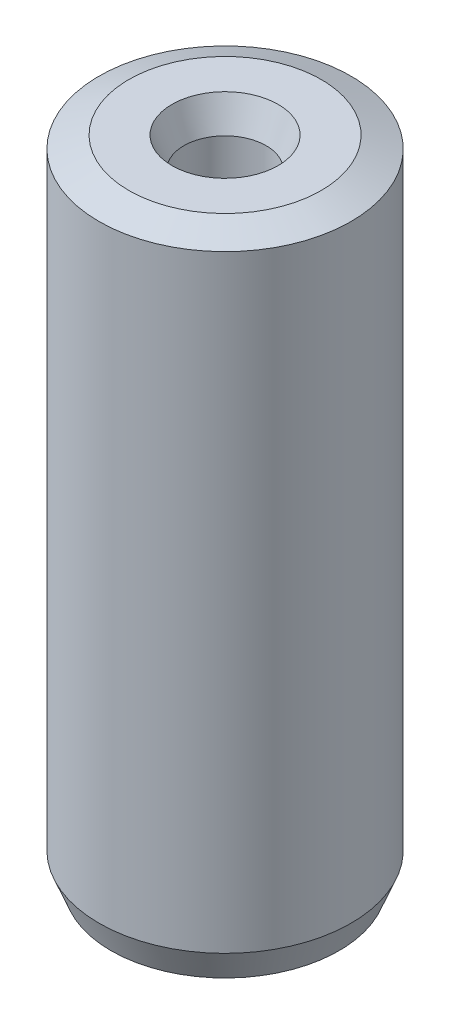
ISO-10303-21;
HEADER;
FILE_DESCRIPTION(('STEP AP214'),'2;1');
FILE_NAME('part.step','',(''),(''),'','','');
FILE_SCHEMA(('AUTOMOTIVE_DESIGN { 1 0 10303 214 1 1 1 1 }'));
ENDSEC;
DATA;
#1=APPLICATION_CONTEXT('core data for automotive mechanical design processes');
#2=APPLICATION_PROTOCOL_DEFINITION('international standard','automotive_design',2000,#1);
#3=PRODUCT_CONTEXT('',#1,'mechanical');
#4=PRODUCT('Part','Part','',(#3));
#5=PRODUCT_RELATED_PRODUCT_CATEGORY('part','',(#4));
#6=PRODUCT_DEFINITION_FORMATION('','',#4);
#7=PRODUCT_DEFINITION_CONTEXT('part definition',#1,'design');
#8=PRODUCT_DEFINITION('design','',#6,#7);
#9=PRODUCT_DEFINITION_SHAPE('','',#8);
#10=(LENGTH_UNIT() NAMED_UNIT(*) SI_UNIT(.MILLI.,.METRE.));
#11=(NAMED_UNIT(*) PLANE_ANGLE_UNIT() SI_UNIT($,.RADIAN.));
#12=(NAMED_UNIT(*) SI_UNIT($,.STERADIAN.) SOLID_ANGLE_UNIT());
#13=UNCERTAINTY_MEASURE_WITH_UNIT(LENGTH_MEASURE(1.E-05),#10,'distance_accuracy_value','');
#14=(GEOMETRIC_REPRESENTATION_CONTEXT(3) GLOBAL_UNCERTAINTY_ASSIGNED_CONTEXT((#13)) GLOBAL_UNIT_ASSIGNED_CONTEXT((#10,
#11,#12)) REPRESENTATION_CONTEXT('',''));
#15=CARTESIAN_POINT('',(0.,0.,0.));
#16=DIRECTION('',(0.,0.,1.));
#17=DIRECTION('',(1.,0.,0.));
#18=AXIS2_PLACEMENT_3D('',#15,#16,#17);
#19=CARTESIAN_POINT('',(0.,25.7761037893323,0.));
#20=DIRECTION('',(0.,-1.,0.));
#21=DIRECTION('',(0.,0.,-1.));
#22=AXIS2_PLACEMENT_3D('',#19,#20,#21);
#23=CYLINDRICAL_SURFACE('',#22,5.);
#24=CARTESIAN_POINT('',(0.,1.18209403228599,0.));
#25=DIRECTION('',(0.,1.,0.));
#26=DIRECTION('',(0.,0.,1.));
#27=AXIS2_PLACEMENT_3D('',#24,#25,#26);
#28=CIRCLE('',#27,5.);
#29=CARTESIAN_POINT('',(0.,1.18209403228599,5.));
#30=VERTEX_POINT('',#29);
#31=EDGE_CURVE('E10',#30,#30,#28,.T.);
#32=ORIENTED_EDGE('',*,*,#31,.T.);
#33=EDGE_LOOP('',(#32));
#34=FACE_BOUND('',#33,.T.);
#35=CARTESIAN_POINT('',(0.,25.3019508736875,0.));
#36=DIRECTION('',(0.,1.,0.));
#37=DIRECTION('',(0.,0.,1.));
#38=AXIS2_PLACEMENT_3D('',#35,#36,#37);
#39=CIRCLE('',#38,5.);
#40=CARTESIAN_POINT('',(0.,25.3019508736875,5.));
#41=VERTEX_POINT('',#40);
#42=EDGE_CURVE('E50',#41,#41,#39,.F.);
#43=ORIENTED_EDGE('',*,*,#42,.T.);
#44=EDGE_LOOP('',(#43));
#45=FACE_BOUND('',#44,.T.);
#46=ADVANCED_FACE('F39',(#34,#45),#23,.T.);
#47=CARTESIAN_POINT('',(0.,25.7761037893323,0.));
#48=DIRECTION('',(0.,1.,0.));
#49=DIRECTION('',(0.,0.,1.));
#50=AXIS2_PLACEMENT_3D('',#47,#48,#49);
#51=PLANE('',#50);
#52=CARTESIAN_POINT('',(0.,25.7761037893323,0.));
#53=DIRECTION('',(0.,1.,0.));
#54=DIRECTION('',(0.,0.,1.));
#55=AXIS2_PLACEMENT_3D('',#52,#53,#54);
#56=CIRCLE('',#55,2.10690864867009);
#57=CARTESIAN_POINT('',(0.,25.7761037893323,2.10690864867009));
#58=VERTEX_POINT('',#57);
#59=EDGE_CURVE('E58',#58,#58,#56,.F.);
#60=ORIENTED_EDGE('',*,*,#59,.T.);
#61=EDGE_LOOP('',(#60));
#62=FACE_BOUND('',#61,.T.);
#63=CARTESIAN_POINT('',(0.,25.7761037893323,0.));
#64=DIRECTION('',(0.,1.,0.));
#65=DIRECTION('',(0.,0.,1.));
#66=AXIS2_PLACEMENT_3D('',#63,#64,#65);
#67=CIRCLE('',#66,3.81790596771398);
#68=CARTESIAN_POINT('',(0.,25.7761037893323,3.81790596771398));
#69=VERTEX_POINT('',#68);
#70=EDGE_CURVE('E61',#69,#69,#67,.T.);
#71=ORIENTED_EDGE('',*,*,#70,.T.);
#72=EDGE_LOOP('',(#71));
#73=FACE_BOUND('',#72,.T.);
#74=ADVANCED_FACE('F88',(#62,#73),#51,.T.);
#75=CARTESIAN_POINT('',(0.,0.,0.));
#76=DIRECTION('',(0.,1.,0.));
#77=DIRECTION('',(0.,0.,1.));
#78=AXIS2_PLACEMENT_3D('',#75,#76,#77);
#79=PLANE('',#78);
#80=CARTESIAN_POINT('',(0.,0.,0.));
#81=DIRECTION('',(0.,1.,0.));
#82=DIRECTION('',(0.,0.,1.));
#83=AXIS2_PLACEMENT_3D('',#80,#81,#82);
#84=CIRCLE('',#83,2.81484976531127);
#85=CARTESIAN_POINT('',(0.,0.,2.81484976531127));
#86=VERTEX_POINT('',#85);
#87=EDGE_CURVE('E51',#86,#86,#84,.T.);
#88=ORIENTED_EDGE('',*,*,#87,.T.);
#89=EDGE_LOOP('',(#88));
#90=FACE_BOUND('',#89,.T.);
#91=CARTESIAN_POINT('',(0.,0.,0.));
#92=DIRECTION('',(0.,1.,0.));
#93=DIRECTION('',(0.,0.,1.));
#94=AXIS2_PLACEMENT_3D('',#91,#92,#93);
#95=CIRCLE('',#94,4.52584708435518);
#96=CARTESIAN_POINT('',(0.,0.,4.52584708435518));
#97=VERTEX_POINT('',#96);
#98=EDGE_CURVE('E54',#97,#97,#95,.F.);
#99=ORIENTED_EDGE('',*,*,#98,.T.);
#100=EDGE_LOOP('',(#99));
#101=FACE_BOUND('',#100,.T.);
#102=ADVANCED_FACE('F83',(#90,#101),#79,.F.);
#103=CARTESIAN_POINT('',(0.,25.7761037893323,0.));
#104=DIRECTION('',(0.,-1.,0.));
#105=DIRECTION('',(0.,0.,-1.));
#106=AXIS2_PLACEMENT_3D('',#103,#104,#105);
#107=CYLINDRICAL_SURFACE('',#106,1.63275573302526);
#108=CARTESIAN_POINT('',(0.,24.5940097570463,0.));
#109=DIRECTION('',(0.,1.,0.));
#110=DIRECTION('',(0.,0.,1.));
#111=AXIS2_PLACEMENT_3D('',#108,#109,#110);
#112=CIRCLE('',#111,1.63275573302526);
#113=CARTESIAN_POINT('',(0.,24.5940097570463,1.63275573302526));
#114=VERTEX_POINT('',#113);
#115=EDGE_CURVE('E67',#114,#114,#112,.T.);
#116=ORIENTED_EDGE('',*,*,#115,.T.);
#117=EDGE_LOOP('',(#116));
#118=FACE_BOUND('',#117,.T.);
#119=CARTESIAN_POINT('',(0.,0.474152915644833,0.));
#120=DIRECTION('',(0.,1.,0.));
#121=DIRECTION('',(0.,0.,1.));
#122=AXIS2_PLACEMENT_3D('',#119,#120,#121);
#123=CIRCLE('',#122,1.63275573302526);
#124=CARTESIAN_POINT('',(0.,0.474152915644833,1.63275573302526));
#125=VERTEX_POINT('',#124);
#126=EDGE_CURVE('E69',#125,#125,#123,.F.);
#127=ORIENTED_EDGE('',*,*,#126,.T.);
#128=EDGE_LOOP('',(#127));
#129=FACE_BOUND('',#128,.T.);
#130=ADVANCED_FACE('F71',(#118,#129),#107,.F.);
#131=CARTESIAN_POINT('',(0.,24.5940097570463,0.));
#132=DIRECTION('',(0.,1.,0.));
#133=DIRECTION('',(0.,0.,1.));
#134=AXIS2_PLACEMENT_3D('',#131,#132,#133);
#135=CONICAL_SURFACE('',#134,1.63275573302526,0.381465223361848);
#136=ORIENTED_EDGE('',*,*,#59,.F.);
#137=EDGE_LOOP('',(#136));
#138=FACE_BOUND('',#137,.T.);
#139=ORIENTED_EDGE('',*,*,#115,.F.);
#140=EDGE_LOOP('',(#139));
#141=FACE_BOUND('',#140,.T.);
#142=ADVANCED_FACE('F77',(#138,#141),#135,.F.);
#143=CARTESIAN_POINT('',(0.,0.,0.));
#144=DIRECTION('',(0.,-1.,0.));
#145=DIRECTION('',(0.,0.,-1.));
#146=AXIS2_PLACEMENT_3D('',#143,#144,#145);
#147=CONICAL_SURFACE('',#146,2.81484976531127,1.18933110343304);
#148=ORIENTED_EDGE('',*,*,#126,.F.);
#149=EDGE_LOOP('',(#148));
#150=FACE_BOUND('',#149,.T.);
#151=ORIENTED_EDGE('',*,*,#87,.F.);
#152=EDGE_LOOP('',(#151));
#153=FACE_BOUND('',#152,.T.);
#154=ADVANCED_FACE('F73',(#150,#153),#147,.F.);
#155=CARTESIAN_POINT('',(0.,1.18209403228599,0.));
#156=DIRECTION('',(0.,1.,0.));
#157=DIRECTION('',(0.,0.,1.));
#158=AXIS2_PLACEMENT_3D('',#155,#156,#157);
#159=CONICAL_SURFACE('',#158,5.,0.381465223361852);
#160=ORIENTED_EDGE('',*,*,#98,.F.);
#161=EDGE_LOOP('',(#160));
#162=FACE_BOUND('',#161,.T.);
#163=ORIENTED_EDGE('',*,*,#31,.F.);
#164=EDGE_LOOP('',(#163));
#165=FACE_BOUND('',#164,.T.);
#166=ADVANCED_FACE('F76',(#162,#165),#159,.T.);
#167=CARTESIAN_POINT('',(0.,25.7761037893323,0.));
#168=DIRECTION('',(0.,-1.,0.));
#169=DIRECTION('',(0.,0.,-1.));
#170=AXIS2_PLACEMENT_3D('',#167,#168,#169);
#171=CONICAL_SURFACE('',#170,3.81790596771398,1.18933110343305);
#172=ORIENTED_EDGE('',*,*,#42,.F.);
#173=EDGE_LOOP('',(#172));
#174=FACE_BOUND('',#173,.T.);
#175=ORIENTED_EDGE('',*,*,#70,.F.);
#176=EDGE_LOOP('',(#175));
#177=FACE_BOUND('',#176,.T.);
#178=ADVANCED_FACE('F45',(#174,#177),#171,.T.);
#179=CLOSED_SHELL('',(#46,#74,#102,#130,#142,#154,#166,#178));
#180=MANIFOLD_SOLID_BREP('B2',#179);
#181=ADVANCED_BREP_SHAPE_REPRESENTATION('',(#18,#180),#14);
#182=SHAPE_DEFINITION_REPRESENTATION(#9,#181);
ENDSEC;
END-ISO-10303-21;
